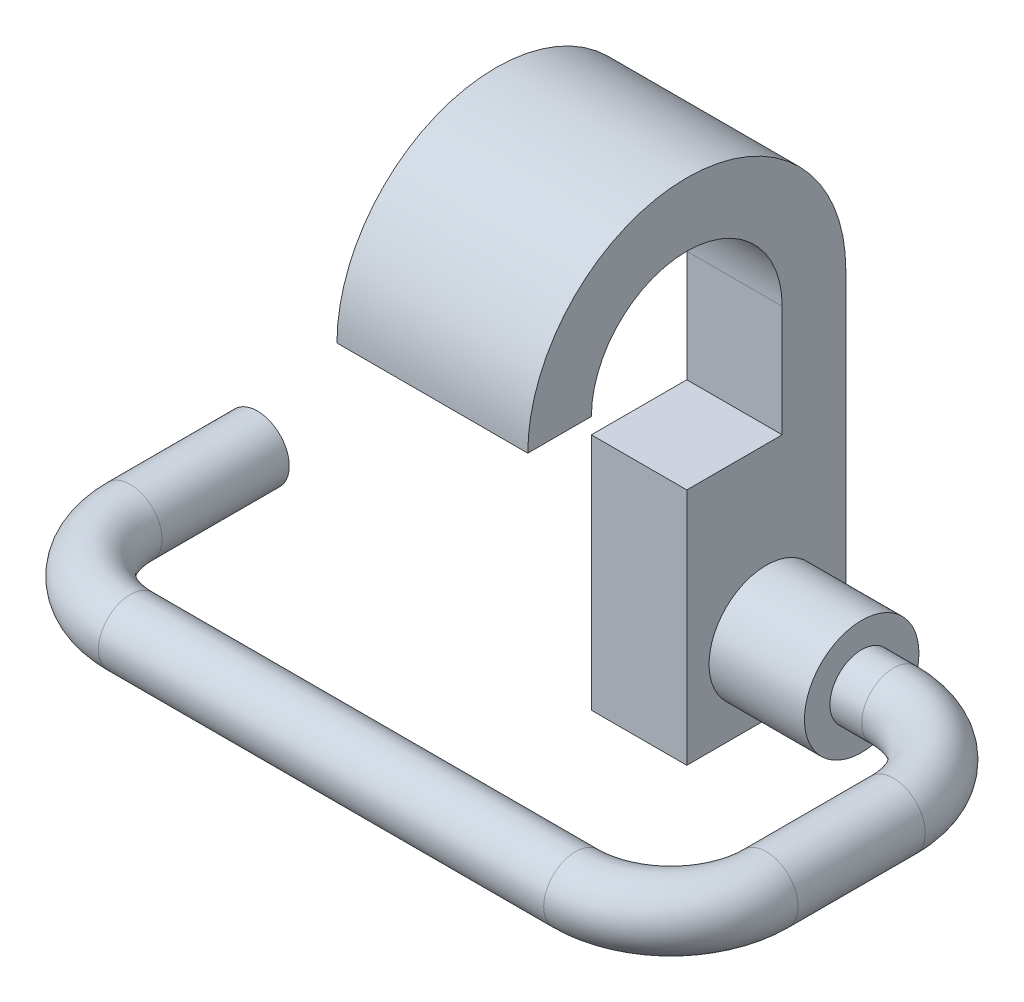
ISO-10303-21;
HEADER;
FILE_DESCRIPTION(('STEP AP214'),'2;1');
FILE_NAME('part.step','',(''),(''),'','','');
FILE_SCHEMA(('AUTOMOTIVE_DESIGN { 1 0 10303 214 1 1 1 1 }'));
ENDSEC;
DATA;
#1=APPLICATION_CONTEXT('core data for automotive mechanical design processes');
#2=APPLICATION_PROTOCOL_DEFINITION('international standard','automotive_design',2000,#1);
#3=PRODUCT_CONTEXT('',#1,'mechanical');
#4=PRODUCT('Part','Part','',(#3));
#5=PRODUCT_RELATED_PRODUCT_CATEGORY('part','',(#4));
#6=PRODUCT_DEFINITION_FORMATION('','',#4);
#7=PRODUCT_DEFINITION_CONTEXT('part definition',#1,'design');
#8=PRODUCT_DEFINITION('design','',#6,#7);
#9=PRODUCT_DEFINITION_SHAPE('','',#8);
#10=(LENGTH_UNIT() NAMED_UNIT(*) SI_UNIT(.MILLI.,.METRE.));
#11=(NAMED_UNIT(*) PLANE_ANGLE_UNIT() SI_UNIT($,.RADIAN.));
#12=(NAMED_UNIT(*) SI_UNIT($,.STERADIAN.) SOLID_ANGLE_UNIT());
#13=UNCERTAINTY_MEASURE_WITH_UNIT(LENGTH_MEASURE(1.E-05),#10,'distance_accuracy_value','');
#14=(GEOMETRIC_REPRESENTATION_CONTEXT(3) GLOBAL_UNCERTAINTY_ASSIGNED_CONTEXT((#13)) GLOBAL_UNIT_ASSIGNED_CONTEXT((#10,
#11,#12)) REPRESENTATION_CONTEXT('',''));
#15=CARTESIAN_POINT('',(0.,0.,0.));
#16=DIRECTION('',(0.,0.,1.));
#17=DIRECTION('',(1.,0.,0.));
#18=AXIS2_PLACEMENT_3D('',#15,#16,#17);
#19=CARTESIAN_POINT('',(1000.,-135.,700.));
#20=DIRECTION('',(0.,0.,-1.));
#21=DIRECTION('',(-1.,0.,0.));
#22=AXIS2_PLACEMENT_3D('',#19,#20,#21);
#23=CYLINDRICAL_SURFACE('',#22,100.);
#24=CARTESIAN_POINT('',(1000.,-135.,700.));
#25=DIRECTION('',(0.,0.,1.));
#26=DIRECTION('',(1.,0.,0.));
#27=AXIS2_PLACEMENT_3D('',#24,#25,#26);
#28=CIRCLE('',#27,100.);
#29=CARTESIAN_POINT('',(1100.,-135.,700.));
#30=VERTEX_POINT('',#29);
#31=EDGE_CURVE('E11',#30,#30,#28,.T.);
#32=ORIENTED_EDGE('',*,*,#31,.F.);
#33=EDGE_LOOP('',(#32));
#34=FACE_BOUND('',#33,.T.);
#35=CARTESIAN_POINT('',(1000.,-135.,300.));
#36=DIRECTION('',(0.,0.,1.));
#37=DIRECTION('',(1.,0.,0.));
#38=AXIS2_PLACEMENT_3D('',#35,#36,#37);
#39=CIRCLE('',#38,100.);
#40=CARTESIAN_POINT('',(1100.,-135.,300.));
#41=VERTEX_POINT('',#40);
#42=EDGE_CURVE('E52',#41,#41,#39,.T.);
#43=ORIENTED_EDGE('',*,*,#42,.T.);
#44=EDGE_LOOP('',(#43));
#45=FACE_BOUND('',#44,.T.);
#46=ADVANCED_FACE('F45',(#34,#45),#23,.T.);
#47=CARTESIAN_POINT('',(1000.,-135.,300.));
#48=DIRECTION('',(0.,0.,1.));
#49=DIRECTION('',(1.,0.,0.));
#50=AXIS2_PLACEMENT_3D('',#47,#48,#49);
#51=PLANE('',#50);
#52=ORIENTED_EDGE('',*,*,#42,.F.);
#53=EDGE_LOOP('',(#52));
#54=FACE_BOUND('',#53,.T.);
#55=ADVANCED_FACE('F83',(#54),#51,.F.);
#56=CARTESIAN_POINT('',(700.,-135.,700.));
#57=DIRECTION('',(0.,-1.,0.));
#58=DIRECTION('',(0.,0.,-1.));
#59=AXIS2_PLACEMENT_3D('',#56,#57,#58);
#60=TOROIDAL_SURFACE('',#59,300.,100.);
#61=CARTESIAN_POINT('',(700.,-135.,1000.));
#62=DIRECTION('',(-1.,0.,0.));
#63=DIRECTION('',(0.,0.,1.));
#64=AXIS2_PLACEMENT_3D('',#61,#62,#63);
#65=CIRCLE('',#64,100.);
#66=CARTESIAN_POINT('',(700.,-135.,1100.));
#67=VERTEX_POINT('',#66);
#68=EDGE_CURVE('E48',#67,#67,#65,.T.);
#69=CARTESIAN_POINT('',(700.,-135.,700.));
#70=DIRECTION('',(0.,-1.,0.));
#71=DIRECTION('',(0.,0.,-1.));
#72=AXIS2_PLACEMENT_3D('',#69,#70,#71);
#73=CIRCLE('',#72,400.);
#74=EDGE_CURVE('',#30,#67,#73,.T.);
#75=ORIENTED_EDGE('',*,*,#31,.T.);
#76=ORIENTED_EDGE('',*,*,#68,.F.);
#77=ORIENTED_EDGE('',*,*,#74,.T.);
#78=ORIENTED_EDGE('',*,*,#74,.F.);
#79=EDGE_LOOP('',(#75,#77,#76,#78));
#80=FACE_BOUND('',#79,.T.);
#81=ADVANCED_FACE('F88',(#80),#60,.T.);
#82=CARTESIAN_POINT('',(0.,-135.,1000.));
#83=DIRECTION('',(1.,0.,0.));
#84=DIRECTION('',(0.,1.,0.));
#85=AXIS2_PLACEMENT_3D('',#82,#83,#84);
#86=CYLINDRICAL_SURFACE('',#85,100.);
#87=ORIENTED_EDGE('',*,*,#68,.T.);
#88=EDGE_LOOP('',(#87));
#89=FACE_BOUND('',#88,.T.);
#90=CARTESIAN_POINT('',(-700.,-135.,1000.));
#91=DIRECTION('',(-1.,0.,0.));
#92=DIRECTION('',(0.,0.,1.));
#93=AXIS2_PLACEMENT_3D('',#90,#91,#92);
#94=CIRCLE('',#93,100.);
#95=CARTESIAN_POINT('',(-700.,-135.,1100.));
#96=VERTEX_POINT('',#95);
#97=EDGE_CURVE('E58',#96,#96,#94,.T.);
#98=ORIENTED_EDGE('',*,*,#97,.F.);
#99=EDGE_LOOP('',(#98));
#100=FACE_BOUND('',#99,.T.);
#101=ADVANCED_FACE('F95',(#89,#100),#86,.T.);
#102=CARTESIAN_POINT('',(-1000.,-135.,700.));
#103=DIRECTION('',(0.,0.,-1.));
#104=DIRECTION('',(1.,0.,0.));
#105=AXIS2_PLACEMENT_3D('',#102,#103,#104);
#106=CYLINDRICAL_SURFACE('',#105,100.);
#107=CARTESIAN_POINT('',(-1000.,-135.,700.));
#108=DIRECTION('',(0.,0.,-1.));
#109=DIRECTION('',(-1.,0.,0.));
#110=AXIS2_PLACEMENT_3D('',#107,#108,#109);
#111=CIRCLE('',#110,100.);
#112=CARTESIAN_POINT('',(-1100.,-135.,700.));
#113=VERTEX_POINT('',#112);
#114=EDGE_CURVE('E64',#113,#113,#111,.T.);
#115=ORIENTED_EDGE('',*,*,#114,.T.);
#116=EDGE_LOOP('',(#115));
#117=FACE_BOUND('',#116,.T.);
#118=CARTESIAN_POINT('',(-1000.,-135.,300.));
#119=DIRECTION('',(0.,0.,-1.));
#120=DIRECTION('',(-1.,0.,0.));
#121=AXIS2_PLACEMENT_3D('',#118,#119,#120);
#122=CIRCLE('',#121,100.);
#123=CARTESIAN_POINT('',(-1100.,-135.,300.));
#124=VERTEX_POINT('',#123);
#125=EDGE_CURVE('E61',#124,#124,#122,.T.);
#126=ORIENTED_EDGE('',*,*,#125,.F.);
#127=EDGE_LOOP('',(#126));
#128=FACE_BOUND('',#127,.T.);
#129=ADVANCED_FACE('F68',(#117,#128),#106,.T.);
#130=CARTESIAN_POINT('',(-1000.,-135.,300.));
#131=DIRECTION('',(0.,0.,1.));
#132=DIRECTION('',(-1.,0.,0.));
#133=AXIS2_PLACEMENT_3D('',#130,#131,#132);
#134=PLANE('',#133);
#135=ORIENTED_EDGE('',*,*,#125,.T.);
#136=EDGE_LOOP('',(#135));
#137=FACE_BOUND('',#136,.T.);
#138=ADVANCED_FACE('F73',(#137),#134,.F.);
#139=CARTESIAN_POINT('',(-700.,-135.,700.));
#140=DIRECTION('',(0.,-1.,0.));
#141=DIRECTION('',(0.,0.,-1.));
#142=AXIS2_PLACEMENT_3D('',#139,#140,#141);
#143=TOROIDAL_SURFACE('',#142,300.,100.);
#144=CARTESIAN_POINT('',(-700.,-135.,700.));
#145=DIRECTION('',(0.,-1.,0.));
#146=DIRECTION('',(0.,0.,-1.));
#147=AXIS2_PLACEMENT_3D('',#144,#145,#146);
#148=CIRCLE('',#147,400.);
#149=EDGE_CURVE('',#96,#113,#148,.T.);
#150=ORIENTED_EDGE('',*,*,#97,.T.);
#151=ORIENTED_EDGE('',*,*,#114,.F.);
#152=ORIENTED_EDGE('',*,*,#149,.T.);
#153=ORIENTED_EDGE('',*,*,#149,.F.);
#154=EDGE_LOOP('',(#150,#152,#151,#153));
#155=FACE_BOUND('',#154,.T.);
#156=ADVANCED_FACE('F71',(#155),#143,.T.);
#157=CLOSED_SHELL('',(#46,#55,#81,#101,#129,#138,#156));
#158=MANIFOLD_SOLID_BREP('B2',#157);
#159=CARTESIAN_POINT('',(700.,-135.,0.));
#160=DIRECTION('',(1.,0.,0.));
#161=DIRECTION('',(0.,0.,-1.));
#162=AXIS2_PLACEMENT_3D('',#159,#160,#161);
#163=PLANE('',#162);
#164=CARTESIAN_POINT('',(700.,-135.,0.));
#165=DIRECTION('',(1.,0.,0.));
#166=DIRECTION('',(0.,0.,-1.));
#167=AXIS2_PLACEMENT_3D('',#164,#165,#166);
#168=CIRCLE('',#167,100.);
#169=CARTESIAN_POINT('',(700.,-135.,-100.));
#170=VERTEX_POINT('',#169);
#171=EDGE_CURVE('E169',#170,#170,#168,.T.);
#172=ORIENTED_EDGE('',*,*,#171,.F.);
#173=EDGE_LOOP('',(#172));
#174=FACE_BOUND('',#173,.T.);
#175=ADVANCED_FACE('F162',(#174),#163,.F.);
#176=CARTESIAN_POINT('',(1000.,-135.,300.));
#177=DIRECTION('',(0.,0.,1.));
#178=DIRECTION('',(1.,0.,0.));
#179=AXIS2_PLACEMENT_3D('',#176,#177,#178);
#180=PLANE('',#179);
#181=CARTESIAN_POINT('',(1000.,-135.,300.));
#182=DIRECTION('',(0.,0.,1.));
#183=DIRECTION('',(1.,0.,0.));
#184=AXIS2_PLACEMENT_3D('',#181,#182,#183);
#185=CIRCLE('',#184,100.);
#186=CARTESIAN_POINT('',(1100.,-135.,300.));
#187=VERTEX_POINT('',#186);
#188=EDGE_CURVE('E43',#187,#187,#185,.T.);
#189=ORIENTED_EDGE('',*,*,#188,.T.);
#190=EDGE_LOOP('',(#189));
#191=FACE_BOUND('',#190,.T.);
#192=ADVANCED_FACE('F176',(#191),#180,.T.);
#193=CARTESIAN_POINT('',(700.,-135.,300.));
#194=DIRECTION('',(0.,-1.,0.));
#195=DIRECTION('',(0.,0.,-1.));
#196=AXIS2_PLACEMENT_3D('',#193,#194,#195);
#197=TOROIDAL_SURFACE('',#196,300.,100.);
#198=ORIENTED_EDGE('',*,*,#188,.F.);
#199=EDGE_LOOP('',(#198));
#200=FACE_BOUND('',#199,.T.);
#201=ORIENTED_EDGE('',*,*,#171,.T.);
#202=EDGE_LOOP('',(#201));
#203=FACE_BOUND('',#202,.T.);
#204=ADVANCED_FACE('F178',(#200,#203),#197,.T.);
#205=CLOSED_SHELL('',(#175,#192,#204));
#206=MANIFOLD_SOLID_BREP('B6',#205);
#207=CARTESIAN_POINT('',(0.,0.,0.));
#208=DIRECTION('',(1.,0.,0.));
#209=DIRECTION('',(0.,0.,-1.));
#210=AXIS2_PLACEMENT_3D('',#207,#208,#209);
#211=PLANE('',#210);
#212=DIRECTION('',(0.,0.,1.));
#213=VECTOR('',#212,1.);
#214=CARTESIAN_POINT('',(0.,725.,-250.));
#215=LINE('',#214,#213);
#216=CARTESIAN_POINT('',(0.,725.,-250.));
#217=VERTEX_POINT('',#216);
#218=CARTESIAN_POINT('',(0.,725.,-50.));
#219=VERTEX_POINT('',#218);
#220=EDGE_CURVE('E301',#217,#219,#215,.T.);
#221=ORIENTED_EDGE('',*,*,#220,.F.);
#222=DIRECTION('',(0.,1.,0.));
#223=VECTOR('',#222,1.);
#224=CARTESIAN_POINT('',(0.,0.,-250.));
#225=LINE('',#224,#223);
#226=CARTESIAN_POINT('',(0.,-375.,-250.));
#227=VERTEX_POINT('',#226);
#228=EDGE_CURVE('E252',#227,#217,#225,.T.);
#229=ORIENTED_EDGE('',*,*,#228,.F.);
#230=DIRECTION('',(0.,0.,-1.));
#231=VECTOR('',#230,1.);
#232=CARTESIAN_POINT('',(0.,-375.,0.));
#233=LINE('',#232,#231);
#234=CARTESIAN_POINT('',(0.,-375.,250.));
#235=VERTEX_POINT('',#234);
#236=EDGE_CURVE('E391',#235,#227,#233,.T.);
#237=ORIENTED_EDGE('',*,*,#236,.F.);
#238=DIRECTION('',(0.,1.,0.));
#239=VECTOR('',#238,1.);
#240=CARTESIAN_POINT('',(0.,0.,250.));
#241=LINE('',#240,#239);
#242=CARTESIAN_POINT('',(0.,375.,250.));
#243=VERTEX_POINT('',#242);
#244=EDGE_CURVE('E381',#235,#243,#241,.T.);
#245=ORIENTED_EDGE('',*,*,#244,.T.);
#246=DIRECTION('',(0.,0.,-1.));
#247=VECTOR('',#246,1.);
#248=CARTESIAN_POINT('',(0.,375.,0.));
#249=LINE('',#248,#247);
#250=CARTESIAN_POINT('',(0.,375.,-50.));
#251=VERTEX_POINT('',#250);
#252=EDGE_CURVE('E303',#243,#251,#249,.T.);
#253=ORIENTED_EDGE('',*,*,#252,.T.);
#254=DIRECTION('',(0.,-1.,0.));
#255=VECTOR('',#254,1.);
#256=CARTESIAN_POINT('',(0.,725.,-50.));
#257=LINE('',#256,#255);
#258=EDGE_CURVE('E291',#219,#251,#257,.T.);
#259=ORIENTED_EDGE('',*,*,#258,.F.);
#260=EDGE_LOOP('',(#221,#229,#237,#245,#253,#259));
#261=FACE_BOUND('',#260,.T.);
#262=ADVANCED_FACE('F207',(#261),#211,.F.);
#263=CARTESIAN_POINT('',(700.,-135.,0.));
#264=DIRECTION('',(-1.,0.,0.));
#265=DIRECTION('',(0.,0.,1.));
#266=AXIS2_PLACEMENT_3D('',#263,#264,#265);
#267=CYLINDRICAL_SURFACE('',#266,100.);
#268=CARTESIAN_POINT('',(600.,-135.,0.));
#269=DIRECTION('',(1.,0.,0.));
#270=DIRECTION('',(0.,0.,-1.));
#271=AXIS2_PLACEMENT_3D('',#268,#269,#270);
#272=CIRCLE('',#271,100.);
#273=CARTESIAN_POINT('',(600.,-135.,-100.));
#274=VERTEX_POINT('',#273);
#275=EDGE_CURVE('E386',#274,#274,#272,.T.);
#276=ORIENTED_EDGE('',*,*,#275,.T.);
#277=EDGE_LOOP('',(#276));
#278=FACE_BOUND('',#277,.T.);
#279=CARTESIAN_POINT('',(700.,-135.,0.));
#280=DIRECTION('',(1.,0.,0.));
#281=DIRECTION('',(0.,0.,-1.));
#282=AXIS2_PLACEMENT_3D('',#279,#280,#281);
#283=CIRCLE('',#282,100.);
#284=CARTESIAN_POINT('',(700.,-135.,-100.));
#285=VERTEX_POINT('',#284);
#286=EDGE_CURVE('E160',#285,#285,#283,.T.);
#287=ORIENTED_EDGE('',*,*,#286,.F.);
#288=EDGE_LOOP('',(#287));
#289=FACE_BOUND('',#288,.T.);
#290=ADVANCED_FACE('F209',(#278,#289),#267,.T.);
#291=CARTESIAN_POINT('',(700.,0.,0.));
#292=DIRECTION('',(1.,0.,0.));
#293=DIRECTION('',(0.,0.,-1.));
#294=AXIS2_PLACEMENT_3D('',#291,#292,#293);
#295=PLANE('',#294);
#296=ORIENTED_EDGE('',*,*,#286,.T.);
#297=EDGE_LOOP('',(#296));
#298=FACE_BOUND('',#297,.T.);
#299=ADVANCED_FACE('F414',(#298),#295,.T.);
#300=CARTESIAN_POINT('',(600.,-135.,0.));
#301=DIRECTION('',(-1.,0.,0.));
#302=DIRECTION('',(0.,0.,1.));
#303=AXIS2_PLACEMENT_3D('',#300,#301,#302);
#304=CYLINDRICAL_SURFACE('',#303,180.);
#305=CARTESIAN_POINT('',(300.,-135.,0.));
#306=DIRECTION('',(1.,0.,0.));
#307=DIRECTION('',(0.,0.,-1.));
#308=AXIS2_PLACEMENT_3D('',#305,#306,#307);
#309=CIRCLE('',#308,180.);
#310=CARTESIAN_POINT('',(300.,-135.,-180.));
#311=VERTEX_POINT('',#310);
#312=EDGE_CURVE('E344',#311,#311,#309,.T.);
#313=ORIENTED_EDGE('',*,*,#312,.T.);
#314=EDGE_LOOP('',(#313));
#315=FACE_BOUND('',#314,.T.);
#316=CARTESIAN_POINT('',(600.,-135.,0.));
#317=DIRECTION('',(1.,0.,0.));
#318=DIRECTION('',(0.,0.,-1.));
#319=AXIS2_PLACEMENT_3D('',#316,#317,#318);
#320=CIRCLE('',#319,180.);
#321=CARTESIAN_POINT('',(600.,-135.,-180.));
#322=VERTEX_POINT('',#321);
#323=EDGE_CURVE('E216',#322,#322,#320,.T.);
#324=ORIENTED_EDGE('',*,*,#323,.F.);
#325=EDGE_LOOP('',(#324));
#326=FACE_BOUND('',#325,.T.);
#327=ADVANCED_FACE('F407',(#315,#326),#304,.T.);
#328=CARTESIAN_POINT('',(600.,0.,0.));
#329=DIRECTION('',(1.,0.,0.));
#330=DIRECTION('',(0.,0.,-1.));
#331=AXIS2_PLACEMENT_3D('',#328,#329,#330);
#332=PLANE('',#331);
#333=ORIENTED_EDGE('',*,*,#275,.F.);
#334=EDGE_LOOP('',(#333));
#335=FACE_BOUND('',#334,.T.);
#336=ORIENTED_EDGE('',*,*,#323,.T.);
#337=EDGE_LOOP('',(#336));
#338=FACE_BOUND('',#337,.T.);
#339=ADVANCED_FACE('F399',(#335,#338),#332,.T.);
#340=CARTESIAN_POINT('',(300.,375.,0.));
#341=DIRECTION('',(0.,1.,0.));
#342=DIRECTION('',(0.,0.,1.));
#343=AXIS2_PLACEMENT_3D('',#340,#341,#342);
#344=PLANE('',#343);
#345=DIRECTION('',(1.,0.,0.));
#346=VECTOR('',#345,1.);
#347=CARTESIAN_POINT('',(0.,375.,-50.));
#348=LINE('',#347,#346);
#349=CARTESIAN_POINT('',(300.,375.,-50.));
#350=VERTEX_POINT('',#349);
#351=EDGE_CURVE('E224',#251,#350,#348,.T.);
#352=ORIENTED_EDGE('',*,*,#351,.F.);
#353=ORIENTED_EDGE('',*,*,#252,.F.);
#354=DIRECTION('',(-1.,0.,0.));
#355=VECTOR('',#354,1.);
#356=CARTESIAN_POINT('',(300.,375.,250.));
#357=LINE('',#356,#355);
#358=CARTESIAN_POINT('',(300.,375.,250.));
#359=VERTEX_POINT('',#358);
#360=EDGE_CURVE('E254',#359,#243,#357,.T.);
#361=ORIENTED_EDGE('',*,*,#360,.F.);
#362=DIRECTION('',(0.,0.,-1.));
#363=VECTOR('',#362,1.);
#364=CARTESIAN_POINT('',(300.,375.,0.));
#365=LINE('',#364,#363);
#366=EDGE_CURVE('E349',#359,#350,#365,.T.);
#367=ORIENTED_EDGE('',*,*,#366,.T.);
#368=EDGE_LOOP('',(#352,#353,#361,#367));
#369=FACE_BOUND('',#368,.T.);
#370=ADVANCED_FACE('F397',(#369),#344,.T.);
#371=CARTESIAN_POINT('',(300.,0.,250.));
#372=DIRECTION('',(0.,0.,1.));
#373=DIRECTION('',(0.,-1.,0.));
#374=AXIS2_PLACEMENT_3D('',#371,#372,#373);
#375=PLANE('',#374);
#376=ORIENTED_EDGE('',*,*,#244,.F.);
#377=DIRECTION('',(-1.,0.,0.));
#378=VECTOR('',#377,1.);
#379=CARTESIAN_POINT('',(300.,-375.,250.));
#380=LINE('',#379,#378);
#381=CARTESIAN_POINT('',(300.,-375.,250.));
#382=VERTEX_POINT('',#381);
#383=EDGE_CURVE('E373',#382,#235,#380,.T.);
#384=ORIENTED_EDGE('',*,*,#383,.F.);
#385=DIRECTION('',(0.,1.,0.));
#386=VECTOR('',#385,1.);
#387=CARTESIAN_POINT('',(300.,0.,250.));
#388=LINE('',#387,#386);
#389=EDGE_CURVE('E375',#382,#359,#388,.T.);
#390=ORIENTED_EDGE('',*,*,#389,.T.);
#391=ORIENTED_EDGE('',*,*,#360,.T.);
#392=EDGE_LOOP('',(#376,#384,#390,#391));
#393=FACE_BOUND('',#392,.T.);
#394=ADVANCED_FACE('F396',(#393),#375,.T.);
#395=CARTESIAN_POINT('',(300.,-375.,0.));
#396=DIRECTION('',(0.,1.,0.));
#397=DIRECTION('',(0.,0.,1.));
#398=AXIS2_PLACEMENT_3D('',#395,#396,#397);
#399=PLANE('',#398);
#400=ORIENTED_EDGE('',*,*,#236,.T.);
#401=DIRECTION('',(-1.,0.,0.));
#402=VECTOR('',#401,1.);
#403=CARTESIAN_POINT('',(300.,-375.,-250.));
#404=LINE('',#403,#402);
#405=CARTESIAN_POINT('',(300.,-375.,-250.));
#406=VERTEX_POINT('',#405);
#407=EDGE_CURVE('E371',#406,#227,#404,.T.);
#408=ORIENTED_EDGE('',*,*,#407,.F.);
#409=DIRECTION('',(0.,0.,-1.));
#410=VECTOR('',#409,1.);
#411=CARTESIAN_POINT('',(300.,-375.,0.));
#412=LINE('',#411,#410);
#413=EDGE_CURVE('E369',#382,#406,#412,.T.);
#414=ORIENTED_EDGE('',*,*,#413,.F.);
#415=ORIENTED_EDGE('',*,*,#383,.T.);
#416=EDGE_LOOP('',(#400,#408,#414,#415));
#417=FACE_BOUND('',#416,.T.);
#418=ADVANCED_FACE('F405',(#417),#399,.F.);
#419=CARTESIAN_POINT('',(300.,0.,-250.));
#420=DIRECTION('',(0.,0.,1.));
#421=DIRECTION('',(0.,-1.,0.));
#422=AXIS2_PLACEMENT_3D('',#419,#420,#421);
#423=PLANE('',#422);
#424=ORIENTED_EDGE('',*,*,#228,.T.);
#425=DIRECTION('',(-1.,0.,0.));
#426=VECTOR('',#425,1.);
#427=CARTESIAN_POINT('',(0.,725.,-250.));
#428=LINE('',#427,#426);
#429=CARTESIAN_POINT('',(300.,725.,-250.));
#430=VERTEX_POINT('',#429);
#431=EDGE_CURVE('E298',#430,#217,#428,.T.);
#432=ORIENTED_EDGE('',*,*,#431,.F.);
#433=DIRECTION('',(0.,1.,0.));
#434=VECTOR('',#433,1.);
#435=CARTESIAN_POINT('',(300.,0.,-250.));
#436=LINE('',#435,#434);
#437=EDGE_CURVE('E233',#406,#430,#436,.T.);
#438=ORIENTED_EDGE('',*,*,#437,.F.);
#439=ORIENTED_EDGE('',*,*,#407,.T.);
#440=EDGE_LOOP('',(#424,#432,#438,#439));
#441=FACE_BOUND('',#440,.T.);
#442=ADVANCED_FACE('F367',(#441),#423,.F.);
#443=CARTESIAN_POINT('',(300.,0.,0.));
#444=DIRECTION('',(1.,0.,0.));
#445=DIRECTION('',(0.,0.,-1.));
#446=AXIS2_PLACEMENT_3D('',#443,#444,#445);
#447=PLANE('',#446);
#448=ORIENTED_EDGE('',*,*,#312,.F.);
#449=EDGE_LOOP('',(#448));
#450=FACE_BOUND('',#449,.T.);
#451=ORIENTED_EDGE('',*,*,#366,.F.);
#452=ORIENTED_EDGE('',*,*,#389,.F.);
#453=ORIENTED_EDGE('',*,*,#413,.T.);
#454=ORIENTED_EDGE('',*,*,#437,.T.);
#455=CARTESIAN_POINT('',(300.,725.,250.));
#456=DIRECTION('',(1.,0.,0.));
#457=DIRECTION('',(0.,0.,-1.));
#458=AXIS2_PLACEMENT_3D('',#455,#456,#457);
#459=CIRCLE('',#458,500.);
#460=CARTESIAN_POINT('',(300.,725.,750.));
#461=VERTEX_POINT('',#460);
#462=EDGE_CURVE('E333',#430,#461,#459,.T.);
#463=ORIENTED_EDGE('',*,*,#462,.T.);
#464=DIRECTION('',(0.,0.,-1.));
#465=VECTOR('',#464,1.);
#466=CARTESIAN_POINT('',(300.,725.,750.));
#467=LINE('',#466,#465);
#468=CARTESIAN_POINT('',(300.,725.,550.));
#469=VERTEX_POINT('',#468);
#470=EDGE_CURVE('E330',#461,#469,#467,.T.);
#471=ORIENTED_EDGE('',*,*,#470,.T.);
#472=CARTESIAN_POINT('',(300.,725.,250.));
#473=DIRECTION('',(1.,0.,0.));
#474=DIRECTION('',(0.,0.,-1.));
#475=AXIS2_PLACEMENT_3D('',#472,#473,#474);
#476=CIRCLE('',#475,300.);
#477=CARTESIAN_POINT('',(300.,725.,-50.));
#478=VERTEX_POINT('',#477);
#479=EDGE_CURVE('E328',#478,#469,#476,.T.);
#480=ORIENTED_EDGE('',*,*,#479,.F.);
#481=DIRECTION('',(0.,-1.,0.));
#482=VECTOR('',#481,1.);
#483=CARTESIAN_POINT('',(300.,725.,-50.));
#484=LINE('',#483,#482);
#485=EDGE_CURVE('E293',#478,#350,#484,.T.);
#486=ORIENTED_EDGE('',*,*,#485,.T.);
#487=EDGE_LOOP('',(#451,#452,#453,#454,#463,#471,#480,#486));
#488=FACE_BOUND('',#487,.T.);
#489=ADVANCED_FACE('F354',(#450,#488),#447,.T.);
#490=CARTESIAN_POINT('',(0.,725.,-50.));
#491=DIRECTION('',(0.,0.,-1.));
#492=DIRECTION('',(-1.,0.,0.));
#493=AXIS2_PLACEMENT_3D('',#490,#491,#492);
#494=PLANE('',#493);
#495=ORIENTED_EDGE('',*,*,#351,.T.);
#496=ORIENTED_EDGE('',*,*,#485,.F.);
#497=DIRECTION('',(1.,0.,0.));
#498=VECTOR('',#497,1.);
#499=CARTESIAN_POINT('',(0.,725.,-50.));
#500=LINE('',#499,#498);
#501=EDGE_CURVE('E288',#219,#478,#500,.T.);
#502=ORIENTED_EDGE('',*,*,#501,.F.);
#503=ORIENTED_EDGE('',*,*,#258,.T.);
#504=EDGE_LOOP('',(#495,#496,#502,#503));
#505=FACE_BOUND('',#504,.T.);
#506=ADVANCED_FACE('F290',(#505),#494,.F.);
#507=CARTESIAN_POINT('',(0.,725.,250.));
#508=DIRECTION('',(1.,0.,0.));
#509=DIRECTION('',(0.,0.,-1.));
#510=AXIS2_PLACEMENT_3D('',#507,#508,#509);
#511=CYLINDRICAL_SURFACE('',#510,300.);
#512=ORIENTED_EDGE('',*,*,#479,.T.);
#513=DIRECTION('',(1.,0.,0.));
#514=VECTOR('',#513,1.);
#515=CARTESIAN_POINT('',(0.,725.,550.));
#516=LINE('',#515,#514);
#517=CARTESIAN_POINT('',(-300.,725.,550.));
#518=VERTEX_POINT('',#517);
#519=EDGE_CURVE('E338',#518,#469,#516,.T.);
#520=ORIENTED_EDGE('',*,*,#519,.F.);
#521=CARTESIAN_POINT('',(-300.,725.,250.));
#522=DIRECTION('',(1.,0.,0.));
#523=DIRECTION('',(0.,0.,-1.));
#524=AXIS2_PLACEMENT_3D('',#521,#522,#523);
#525=CIRCLE('',#524,300.);
#526=CARTESIAN_POINT('',(-300.,725.,-50.));
#527=VERTEX_POINT('',#526);
#528=EDGE_CURVE('E308',#527,#518,#525,.T.);
#529=ORIENTED_EDGE('',*,*,#528,.F.);
#530=DIRECTION('',(-1.,0.,0.));
#531=VECTOR('',#530,1.);
#532=CARTESIAN_POINT('',(0.,725.,-50.));
#533=LINE('',#532,#531);
#534=EDGE_CURVE('E305',#219,#527,#533,.T.);
#535=ORIENTED_EDGE('',*,*,#534,.F.);
#536=ORIENTED_EDGE('',*,*,#501,.T.);
#537=EDGE_LOOP('',(#512,#520,#529,#535,#536));
#538=FACE_BOUND('',#537,.T.);
#539=ADVANCED_FACE('F306',(#538),#511,.F.);
#540=CARTESIAN_POINT('',(0.,725.,750.));
#541=DIRECTION('',(0.,-1.,0.));
#542=DIRECTION('',(0.,0.,-1.));
#543=AXIS2_PLACEMENT_3D('',#540,#541,#542);
#544=PLANE('',#543);
#545=ORIENTED_EDGE('',*,*,#470,.F.);
#546=DIRECTION('',(1.,0.,0.));
#547=VECTOR('',#546,1.);
#548=CARTESIAN_POINT('',(0.,725.,750.));
#549=LINE('',#548,#547);
#550=CARTESIAN_POINT('',(-300.,725.,750.));
#551=VERTEX_POINT('',#550);
#552=EDGE_CURVE('E336',#551,#461,#549,.T.);
#553=ORIENTED_EDGE('',*,*,#552,.F.);
#554=DIRECTION('',(0.,0.,-1.));
#555=VECTOR('',#554,1.);
#556=CARTESIAN_POINT('',(-300.,725.,750.));
#557=LINE('',#556,#555);
#558=EDGE_CURVE('E317',#551,#518,#557,.T.);
#559=ORIENTED_EDGE('',*,*,#558,.T.);
#560=ORIENTED_EDGE('',*,*,#519,.T.);
#561=EDGE_LOOP('',(#545,#553,#559,#560));
#562=FACE_BOUND('',#561,.T.);
#563=ADVANCED_FACE('F360',(#562),#544,.T.);
#564=CARTESIAN_POINT('',(0.,725.,250.));
#565=DIRECTION('',(1.,0.,0.));
#566=DIRECTION('',(0.,0.,-1.));
#567=AXIS2_PLACEMENT_3D('',#564,#565,#566);
#568=CYLINDRICAL_SURFACE('',#567,500.);
#569=ORIENTED_EDGE('',*,*,#462,.F.);
#570=ORIENTED_EDGE('',*,*,#431,.T.);
#571=DIRECTION('',(-1.,0.,0.));
#572=VECTOR('',#571,1.);
#573=CARTESIAN_POINT('',(0.,725.,-250.));
#574=LINE('',#573,#572);
#575=CARTESIAN_POINT('',(-300.,725.,-250.));
#576=VERTEX_POINT('',#575);
#577=EDGE_CURVE('E312',#217,#576,#574,.T.);
#578=ORIENTED_EDGE('',*,*,#577,.T.);
#579=CARTESIAN_POINT('',(-300.,725.,250.));
#580=DIRECTION('',(1.,0.,0.));
#581=DIRECTION('',(0.,0.,-1.));
#582=AXIS2_PLACEMENT_3D('',#579,#580,#581);
#583=CIRCLE('',#582,500.);
#584=EDGE_CURVE('E322',#576,#551,#583,.T.);
#585=ORIENTED_EDGE('',*,*,#584,.T.);
#586=ORIENTED_EDGE('',*,*,#552,.T.);
#587=EDGE_LOOP('',(#569,#570,#578,#585,#586));
#588=FACE_BOUND('',#587,.T.);
#589=ADVANCED_FACE('F366',(#588),#568,.T.);
#590=CARTESIAN_POINT('',(0.,725.,-250.));
#591=DIRECTION('',(0.,-1.,0.));
#592=DIRECTION('',(0.,0.,-1.));
#593=AXIS2_PLACEMENT_3D('',#590,#591,#592);
#594=PLANE('',#593);
#595=DIRECTION('',(0.,0.,1.));
#596=VECTOR('',#595,1.);
#597=CARTESIAN_POINT('',(-300.,725.,-250.));
#598=LINE('',#597,#596);
#599=EDGE_CURVE('E320',#576,#527,#598,.T.);
#600=ORIENTED_EDGE('',*,*,#599,.F.);
#601=ORIENTED_EDGE('',*,*,#577,.F.);
#602=ORIENTED_EDGE('',*,*,#220,.T.);
#603=ORIENTED_EDGE('',*,*,#534,.T.);
#604=EDGE_LOOP('',(#600,#601,#602,#603));
#605=FACE_BOUND('',#604,.T.);
#606=ADVANCED_FACE('F315',(#605),#594,.T.);
#607=CARTESIAN_POINT('',(-300.,725.,250.));
#608=DIRECTION('',(-1.,0.,0.));
#609=DIRECTION('',(0.,0.,-1.));
#610=AXIS2_PLACEMENT_3D('',#607,#608,#609);
#611=PLANE('',#610);
#612=ORIENTED_EDGE('',*,*,#599,.T.);
#613=ORIENTED_EDGE('',*,*,#528,.T.);
#614=ORIENTED_EDGE('',*,*,#558,.F.);
#615=ORIENTED_EDGE('',*,*,#584,.F.);
#616=EDGE_LOOP('',(#612,#613,#614,#615));
#617=FACE_BOUND('',#616,.T.);
#618=ADVANCED_FACE('F363',(#617),#611,.T.);
#619=CLOSED_SHELL('',(#262,#290,#299,#327,#339,#370,#394,#418,#442,#489,#506,#539,#563,#589,
#606,#618));
#620=MANIFOLD_SOLID_BREP('B37',#619);
#621=ADVANCED_BREP_SHAPE_REPRESENTATION('',(#18,#158,#206,#620),#14);
#622=SHAPE_DEFINITION_REPRESENTATION(#9,#621);
ENDSEC;
END-ISO-10303-21;
